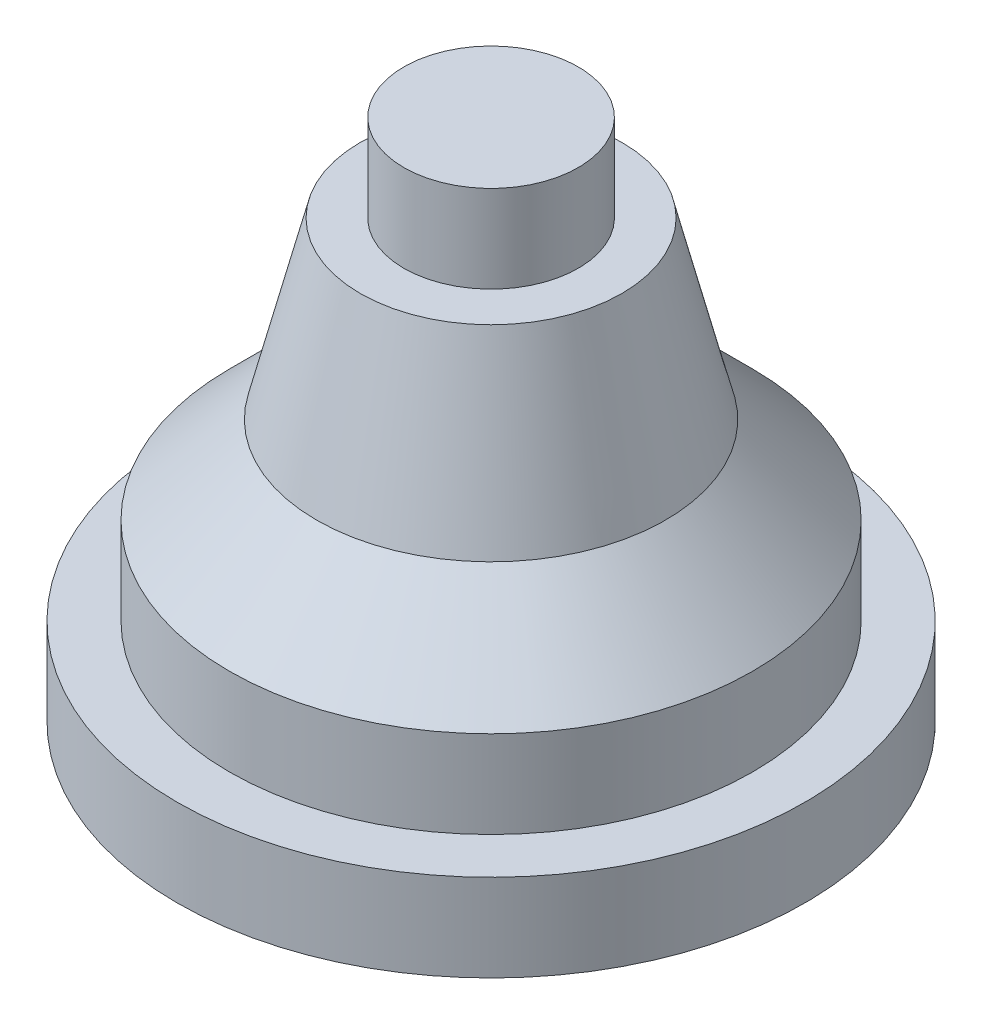
ISO-10303-21;
HEADER;
FILE_DESCRIPTION(('STEP AP214'),'2;1');
FILE_NAME('part.step','',(''),(''),'','','');
FILE_SCHEMA(('AUTOMOTIVE_DESIGN { 1 0 10303 214 1 1 1 1 }'));
ENDSEC;
DATA;
#1=APPLICATION_CONTEXT('core data for automotive mechanical design processes');
#2=APPLICATION_PROTOCOL_DEFINITION('international standard','automotive_design',2000,#1);
#3=PRODUCT_CONTEXT('',#1,'mechanical');
#4=PRODUCT('Part','Part','',(#3));
#5=PRODUCT_RELATED_PRODUCT_CATEGORY('part','',(#4));
#6=PRODUCT_DEFINITION_FORMATION('','',#4);
#7=PRODUCT_DEFINITION_CONTEXT('part definition',#1,'design');
#8=PRODUCT_DEFINITION('design','',#6,#7);
#9=PRODUCT_DEFINITION_SHAPE('','',#8);
#10=(LENGTH_UNIT() NAMED_UNIT(*) SI_UNIT(.MILLI.,.METRE.));
#11=(NAMED_UNIT(*) PLANE_ANGLE_UNIT() SI_UNIT($,.RADIAN.));
#12=(NAMED_UNIT(*) SI_UNIT($,.STERADIAN.) SOLID_ANGLE_UNIT());
#13=UNCERTAINTY_MEASURE_WITH_UNIT(LENGTH_MEASURE(1.E-05),#10,'distance_accuracy_value','');
#14=(GEOMETRIC_REPRESENTATION_CONTEXT(3) GLOBAL_UNCERTAINTY_ASSIGNED_CONTEXT((#13)) GLOBAL_UNIT_ASSIGNED_CONTEXT((#10,
#11,#12)) REPRESENTATION_CONTEXT('',''));
#15=CARTESIAN_POINT('',(0.,0.,0.));
#16=DIRECTION('',(0.,0.,1.));
#17=DIRECTION('',(1.,0.,0.));
#18=AXIS2_PLACEMENT_3D('',#15,#16,#17);
#19=CARTESIAN_POINT('',(0.,75.,0.));
#20=DIRECTION('',(0.,-1.,0.));
#21=DIRECTION('',(0.,0.,-1.));
#22=AXIS2_PLACEMENT_3D('',#19,#20,#21);
#23=PLANE('',#22);
#24=CARTESIAN_POINT('',(0.,75.,0.));
#25=DIRECTION('',(0.,1.,0.));
#26=DIRECTION('',(0.,0.,1.));
#27=AXIS2_PLACEMENT_3D('',#24,#25,#26);
#28=CIRCLE('',#27,25.);
#29=CARTESIAN_POINT('',(0.,75.,25.));
#30=VERTEX_POINT('',#29);
#31=EDGE_CURVE('E10',#30,#30,#28,.T.);
#32=ORIENTED_EDGE('',*,*,#31,.T.);
#33=EDGE_LOOP('',(#32));
#34=FACE_BOUND('',#33,.T.);
#35=ADVANCED_FACE('F29',(#34),#23,.F.);
#36=CARTESIAN_POINT('',(0.,54.909632034632,0.));
#37=DIRECTION('',(0.,1.,0.));
#38=DIRECTION('',(0.,0.,1.));
#39=AXIS2_PLACEMENT_3D('',#36,#37,#38);
#40=CYLINDRICAL_SURFACE('',#39,25.);
#41=ORIENTED_EDGE('',*,*,#31,.F.);
#42=EDGE_LOOP('',(#41));
#43=FACE_BOUND('',#42,.T.);
#44=CARTESIAN_POINT('',(0.,50.,0.));
#45=DIRECTION('',(0.,1.,0.));
#46=DIRECTION('',(0.,0.,1.));
#47=AXIS2_PLACEMENT_3D('',#44,#45,#46);
#48=CIRCLE('',#47,25.);
#49=CARTESIAN_POINT('',(0.,50.,25.));
#50=VERTEX_POINT('',#49);
#51=EDGE_CURVE('E35',#50,#50,#48,.T.);
#52=ORIENTED_EDGE('',*,*,#51,.T.);
#53=EDGE_LOOP('',(#52));
#54=FACE_BOUND('',#53,.T.);
#55=ADVANCED_FACE('F73',(#43,#54),#40,.T.);
#56=CARTESIAN_POINT('',(25.,50.,0.));
#57=DIRECTION('',(0.,-1.,0.));
#58=DIRECTION('',(0.,0.,-1.));
#59=AXIS2_PLACEMENT_3D('',#56,#57,#58);
#60=PLANE('',#59);
#61=ORIENTED_EDGE('',*,*,#51,.F.);
#62=EDGE_LOOP('',(#61));
#63=FACE_BOUND('',#62,.T.);
#64=CARTESIAN_POINT('',(0.,50.,0.));
#65=DIRECTION('',(0.,1.,0.));
#66=DIRECTION('',(0.,0.,1.));
#67=AXIS2_PLACEMENT_3D('',#64,#65,#66);
#68=CIRCLE('',#67,37.5);
#69=CARTESIAN_POINT('',(0.,50.,37.5));
#70=VERTEX_POINT('',#69);
#71=EDGE_CURVE('E39',#70,#70,#68,.T.);
#72=ORIENTED_EDGE('',*,*,#71,.T.);
#73=EDGE_LOOP('',(#72));
#74=FACE_BOUND('',#73,.T.);
#75=ADVANCED_FACE('F77',(#63,#74),#60,.F.);
#76=CARTESIAN_POINT('',(0.,0.,0.));
#77=DIRECTION('',(0.,-1.,0.));
#78=DIRECTION('',(0.,0.,-1.));
#79=AXIS2_PLACEMENT_3D('',#76,#77,#78);
#80=CONICAL_SURFACE('',#79,50.,0.244978663126864);
#81=ORIENTED_EDGE('',*,*,#71,.F.);
#82=EDGE_LOOP('',(#81));
#83=FACE_BOUND('',#82,.T.);
#84=CARTESIAN_POINT('',(0.,0.,0.));
#85=DIRECTION('',(0.,1.,0.));
#86=DIRECTION('',(0.,0.,1.));
#87=AXIS2_PLACEMENT_3D('',#84,#85,#86);
#88=CIRCLE('',#87,50.);
#89=CARTESIAN_POINT('',(0.,0.,50.));
#90=VERTEX_POINT('',#89);
#91=EDGE_CURVE('E43',#90,#90,#88,.T.);
#92=ORIENTED_EDGE('',*,*,#91,.T.);
#93=EDGE_LOOP('',(#92));
#94=FACE_BOUND('',#93,.T.);
#95=ADVANCED_FACE('F82',(#83,#94),#80,.T.);
#96=CARTESIAN_POINT('',(0.,-25.,0.));
#97=DIRECTION('',(0.,-1.,0.));
#98=DIRECTION('',(0.,0.,-1.));
#99=AXIS2_PLACEMENT_3D('',#96,#97,#98);
#100=CONICAL_SURFACE('',#99,75.,0.785398163397448);
#101=ORIENTED_EDGE('',*,*,#91,.F.);
#102=EDGE_LOOP('',(#101));
#103=FACE_BOUND('',#102,.T.);
#104=CARTESIAN_POINT('',(0.,-25.,0.));
#105=DIRECTION('',(0.,1.,0.));
#106=DIRECTION('',(0.,0.,1.));
#107=AXIS2_PLACEMENT_3D('',#104,#105,#106);
#108=CIRCLE('',#107,75.);
#109=CARTESIAN_POINT('',(0.,-25.,75.));
#110=VERTEX_POINT('',#109);
#111=EDGE_CURVE('E48',#110,#110,#108,.T.);
#112=ORIENTED_EDGE('',*,*,#111,.T.);
#113=EDGE_LOOP('',(#112));
#114=FACE_BOUND('',#113,.T.);
#115=ADVANCED_FACE('F88',(#103,#114),#100,.T.);
#116=CARTESIAN_POINT('',(0.,54.909632034632,0.));
#117=DIRECTION('',(0.,1.,0.));
#118=DIRECTION('',(0.,0.,1.));
#119=AXIS2_PLACEMENT_3D('',#116,#117,#118);
#120=CYLINDRICAL_SURFACE('',#119,75.);
#121=ORIENTED_EDGE('',*,*,#111,.F.);
#122=EDGE_LOOP('',(#121));
#123=FACE_BOUND('',#122,.T.);
#124=CARTESIAN_POINT('',(0.,-50.,0.));
#125=DIRECTION('',(0.,1.,0.));
#126=DIRECTION('',(0.,0.,1.));
#127=AXIS2_PLACEMENT_3D('',#124,#125,#126);
#128=CIRCLE('',#127,75.);
#129=CARTESIAN_POINT('',(0.,-50.,75.));
#130=VERTEX_POINT('',#129);
#131=EDGE_CURVE('E51',#130,#130,#128,.T.);
#132=ORIENTED_EDGE('',*,*,#131,.T.);
#133=EDGE_LOOP('',(#132));
#134=FACE_BOUND('',#133,.T.);
#135=ADVANCED_FACE('F92',(#123,#134),#120,.T.);
#136=CARTESIAN_POINT('',(75.,-50.,0.));
#137=DIRECTION('',(0.,-1.,0.));
#138=DIRECTION('',(0.,0.,-1.));
#139=AXIS2_PLACEMENT_3D('',#136,#137,#138);
#140=PLANE('',#139);
#141=ORIENTED_EDGE('',*,*,#131,.F.);
#142=EDGE_LOOP('',(#141));
#143=FACE_BOUND('',#142,.T.);
#144=CARTESIAN_POINT('',(0.,-50.,0.));
#145=DIRECTION('',(0.,1.,0.));
#146=DIRECTION('',(0.,0.,1.));
#147=AXIS2_PLACEMENT_3D('',#144,#145,#146);
#148=CIRCLE('',#147,90.);
#149=CARTESIAN_POINT('',(0.,-50.,90.));
#150=VERTEX_POINT('',#149);
#151=EDGE_CURVE('E54',#150,#150,#148,.T.);
#152=ORIENTED_EDGE('',*,*,#151,.T.);
#153=EDGE_LOOP('',(#152));
#154=FACE_BOUND('',#153,.T.);
#155=ADVANCED_FACE('F69',(#143,#154),#140,.F.);
#156=CARTESIAN_POINT('',(0.,54.909632034632,0.));
#157=DIRECTION('',(0.,1.,0.));
#158=DIRECTION('',(0.,0.,1.));
#159=AXIS2_PLACEMENT_3D('',#156,#157,#158);
#160=CYLINDRICAL_SURFACE('',#159,90.);
#161=ORIENTED_EDGE('',*,*,#151,.F.);
#162=EDGE_LOOP('',(#161));
#163=FACE_BOUND('',#162,.T.);
#164=CARTESIAN_POINT('',(0.,-75.,0.));
#165=DIRECTION('',(0.,1.,0.));
#166=DIRECTION('',(0.,0.,1.));
#167=AXIS2_PLACEMENT_3D('',#164,#165,#166);
#168=CIRCLE('',#167,90.);
#169=CARTESIAN_POINT('',(0.,-75.,90.));
#170=VERTEX_POINT('',#169);
#171=EDGE_CURVE('E57',#170,#170,#168,.T.);
#172=ORIENTED_EDGE('',*,*,#171,.T.);
#173=EDGE_LOOP('',(#172));
#174=FACE_BOUND('',#173,.T.);
#175=ADVANCED_FACE('F61',(#163,#174),#160,.T.);
#176=CARTESIAN_POINT('',(90.,-75.,0.));
#177=DIRECTION('',(0.,1.,0.));
#178=DIRECTION('',(0.,0.,1.));
#179=AXIS2_PLACEMENT_3D('',#176,#177,#178);
#180=PLANE('',#179);
#181=ORIENTED_EDGE('',*,*,#171,.F.);
#182=EDGE_LOOP('',(#181));
#183=FACE_BOUND('',#182,.T.);
#184=ADVANCED_FACE('F63',(#183),#180,.F.);
#185=CLOSED_SHELL('',(#35,#55,#75,#95,#115,#135,#155,#175,#184));
#186=MANIFOLD_SOLID_BREP('B2',#185);
#187=ADVANCED_BREP_SHAPE_REPRESENTATION('',(#18,#186),#14);
#188=SHAPE_DEFINITION_REPRESENTATION(#9,#187);
ENDSEC;
END-ISO-10303-21;
